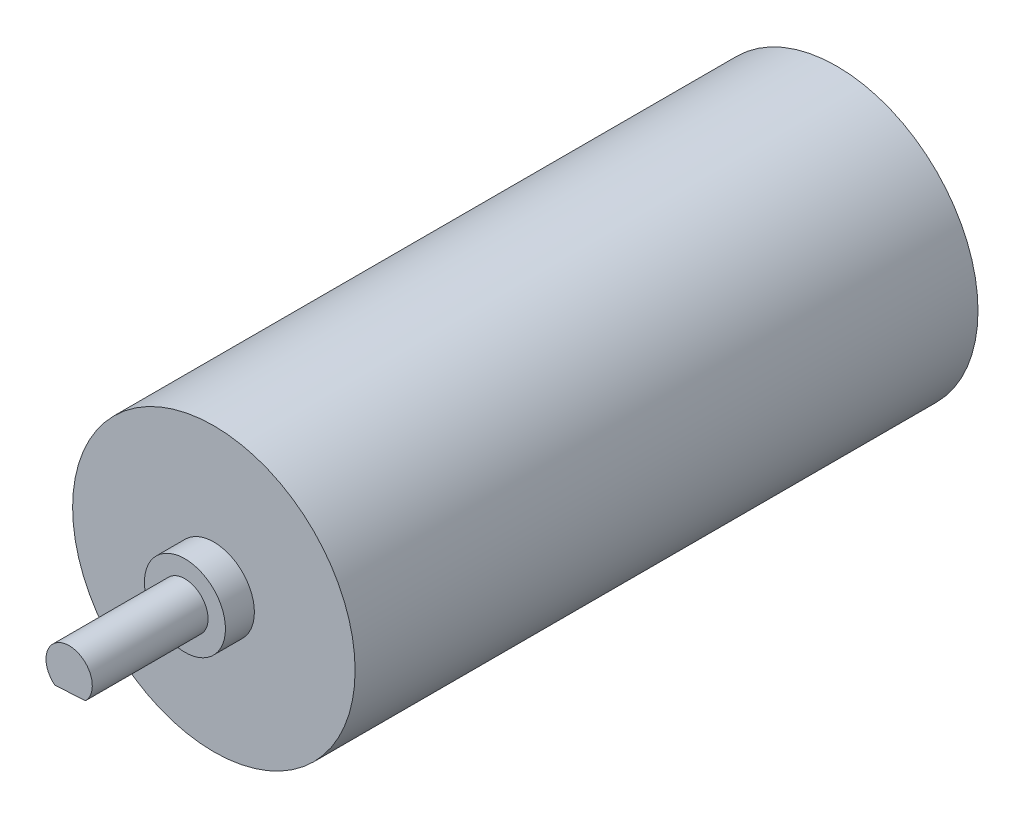
ISO-10303-21;
HEADER;
FILE_DESCRIPTION(('STEP AP214'),'2;1');
FILE_NAME('part.step','',(''),(''),'','','');
FILE_SCHEMA(('AUTOMOTIVE_DESIGN { 1 0 10303 214 1 1 1 1 }'));
ENDSEC;
DATA;
#1=APPLICATION_CONTEXT('core data for automotive mechanical design processes');
#2=APPLICATION_PROTOCOL_DEFINITION('international standard','automotive_design',2000,#1);
#3=PRODUCT_CONTEXT('',#1,'mechanical');
#4=PRODUCT('Part','Part','',(#3));
#5=PRODUCT_RELATED_PRODUCT_CATEGORY('part','',(#4));
#6=PRODUCT_DEFINITION_FORMATION('','',#4);
#7=PRODUCT_DEFINITION_CONTEXT('part definition',#1,'design');
#8=PRODUCT_DEFINITION('design','',#6,#7);
#9=PRODUCT_DEFINITION_SHAPE('','',#8);
#10=(LENGTH_UNIT() NAMED_UNIT(*) SI_UNIT(.MILLI.,.METRE.));
#11=(NAMED_UNIT(*) PLANE_ANGLE_UNIT() SI_UNIT($,.RADIAN.));
#12=(NAMED_UNIT(*) SI_UNIT($,.STERADIAN.) SOLID_ANGLE_UNIT());
#13=UNCERTAINTY_MEASURE_WITH_UNIT(LENGTH_MEASURE(1.E-05),#10,'distance_accuracy_value','');
#14=(GEOMETRIC_REPRESENTATION_CONTEXT(3) GLOBAL_UNCERTAINTY_ASSIGNED_CONTEXT((#13)) GLOBAL_UNIT_ASSIGNED_CONTEXT((#10,
#11,#12)) REPRESENTATION_CONTEXT('',''));
#15=CARTESIAN_POINT('',(0.,0.,0.));
#16=DIRECTION('',(0.,0.,1.));
#17=DIRECTION('',(1.,0.,0.));
#18=AXIS2_PLACEMENT_3D('',#15,#16,#17);
#19=CARTESIAN_POINT('',(0.,0.,26.9));
#20=DIRECTION('',(0.,0.,-1.));
#21=DIRECTION('',(-1.,0.,0.));
#22=AXIS2_PLACEMENT_3D('',#19,#20,#21);
#23=CYLINDRICAL_SURFACE('',#22,12.2);
#24=CARTESIAN_POINT('',(0.,0.,26.9));
#25=DIRECTION('',(0.,0.,1.));
#26=DIRECTION('',(1.,0.,0.));
#27=AXIS2_PLACEMENT_3D('',#24,#25,#26);
#28=CIRCLE('',#27,12.2);
#29=CARTESIAN_POINT('',(12.2,0.,26.9));
#30=VERTEX_POINT('',#29);
#31=EDGE_CURVE('E81',#30,#30,#28,.T.);
#32=ORIENTED_EDGE('',*,*,#31,.F.);
#33=EDGE_LOOP('',(#32));
#34=FACE_BOUND('',#33,.T.);
#35=CARTESIAN_POINT('',(0.,0.,-26.9));
#36=DIRECTION('',(0.,0.,1.));
#37=DIRECTION('',(1.,0.,0.));
#38=AXIS2_PLACEMENT_3D('',#35,#36,#37);
#39=CIRCLE('',#38,12.2);
#40=CARTESIAN_POINT('',(12.2,0.,-26.9));
#41=VERTEX_POINT('',#40);
#42=EDGE_CURVE('E36',#41,#41,#39,.T.);
#43=ORIENTED_EDGE('',*,*,#42,.T.);
#44=EDGE_LOOP('',(#43));
#45=FACE_BOUND('',#44,.T.);
#46=ADVANCED_FACE('F33',(#34,#45),#23,.T.);
#47=CARTESIAN_POINT('',(0.,0.,26.9));
#48=DIRECTION('',(0.,0.,1.));
#49=DIRECTION('',(1.,0.,0.));
#50=AXIS2_PLACEMENT_3D('',#47,#48,#49);
#51=PLANE('',#50);
#52=CARTESIAN_POINT('',(0.,0.,26.9));
#53=DIRECTION('',(0.,0.,1.));
#54=DIRECTION('',(1.,0.,0.));
#55=AXIS2_PLACEMENT_3D('',#52,#53,#54);
#56=CIRCLE('',#55,3.5);
#57=CARTESIAN_POINT('',(3.5,0.,26.9));
#58=VERTEX_POINT('',#57);
#59=EDGE_CURVE('E41',#58,#58,#56,.T.);
#60=ORIENTED_EDGE('',*,*,#59,.F.);
#61=EDGE_LOOP('',(#60));
#62=FACE_BOUND('',#61,.T.);
#63=ORIENTED_EDGE('',*,*,#31,.T.);
#64=EDGE_LOOP('',(#63));
#65=FACE_BOUND('',#64,.T.);
#66=ADVANCED_FACE('F92',(#62,#65),#51,.T.);
#67=CARTESIAN_POINT('',(0.,0.,-26.9));
#68=DIRECTION('',(0.,0.,1.));
#69=DIRECTION('',(1.,0.,0.));
#70=AXIS2_PLACEMENT_3D('',#67,#68,#69);
#71=PLANE('',#70);
#72=ORIENTED_EDGE('',*,*,#42,.F.);
#73=EDGE_LOOP('',(#72));
#74=FACE_BOUND('',#73,.T.);
#75=ADVANCED_FACE('F89',(#74),#71,.F.);
#76=CARTESIAN_POINT('',(0.,0.,29.4));
#77=DIRECTION('',(0.,0.,-1.));
#78=DIRECTION('',(-1.,0.,0.));
#79=AXIS2_PLACEMENT_3D('',#76,#77,#78);
#80=CYLINDRICAL_SURFACE('',#79,3.5);
#81=CARTESIAN_POINT('',(0.,0.,29.4));
#82=DIRECTION('',(0.,0.,1.));
#83=DIRECTION('',(1.,0.,0.));
#84=AXIS2_PLACEMENT_3D('',#81,#82,#83);
#85=CIRCLE('',#84,3.5);
#86=CARTESIAN_POINT('',(3.5,0.,29.4));
#87=VERTEX_POINT('',#86);
#88=EDGE_CURVE('E74',#87,#87,#85,.T.);
#89=ORIENTED_EDGE('',*,*,#88,.F.);
#90=EDGE_LOOP('',(#89));
#91=FACE_BOUND('',#90,.T.);
#92=ORIENTED_EDGE('',*,*,#59,.T.);
#93=EDGE_LOOP('',(#92));
#94=FACE_BOUND('',#93,.T.);
#95=ADVANCED_FACE('F91',(#91,#94),#80,.T.);
#96=CARTESIAN_POINT('',(0.,0.,29.4));
#97=DIRECTION('',(0.,0.,1.));
#98=DIRECTION('',(1.,0.,0.));
#99=AXIS2_PLACEMENT_3D('',#96,#97,#98);
#100=PLANE('',#99);
#101=CARTESIAN_POINT('',(0.,0.,29.4));
#102=DIRECTION('',(0.,0.,1.));
#103=DIRECTION('',(1.,0.,0.));
#104=AXIS2_PLACEMENT_3D('',#101,#102,#103);
#105=CIRCLE('',#104,2.);
#106=CARTESIAN_POINT('',(2.,0.,29.4));
#107=VERTEX_POINT('',#106);
#108=EDGE_CURVE('E11',#107,#107,#105,.T.);
#109=ORIENTED_EDGE('',*,*,#108,.F.);
#110=EDGE_LOOP('',(#109));
#111=FACE_BOUND('',#110,.T.);
#112=ORIENTED_EDGE('',*,*,#88,.T.);
#113=EDGE_LOOP('',(#112));
#114=FACE_BOUND('',#113,.T.);
#115=ADVANCED_FACE('F97',(#111,#114),#100,.T.);
#116=CARTESIAN_POINT('',(0.,0.,39.4));
#117=DIRECTION('',(0.,0.,-1.));
#118=DIRECTION('',(-1.,0.,0.));
#119=AXIS2_PLACEMENT_3D('',#116,#117,#118);
#120=CYLINDRICAL_SURFACE('',#119,2.);
#121=CARTESIAN_POINT('',(0.,0.,39.4));
#122=DIRECTION('',(0.,0.,1.));
#123=DIRECTION('',(1.,0.,0.));
#124=AXIS2_PLACEMENT_3D('',#121,#122,#123);
#125=CIRCLE('',#124,2.);
#126=CARTESIAN_POINT('',(1.40749511869052,-1.4209002395884,39.4));
#127=VERTEX_POINT('',#126);
#128=CARTESIAN_POINT('',(-1.23381886208231,-1.57406830079572,39.4));
#129=VERTEX_POINT('',#128);
#130=EDGE_CURVE('E71',#127,#129,#125,.T.);
#131=ORIENTED_EDGE('',*,*,#130,.F.);
#132=DIRECTION('',(0.,0.,1.));
#133=VECTOR('',#132,1.);
#134=CARTESIAN_POINT('',(1.40749511869051,-1.4209002395884,31.4));
#135=LINE('',#134,#133);
#136=CARTESIAN_POINT('',(1.40749511869051,-1.4209002395884,31.4));
#137=VERTEX_POINT('',#136);
#138=EDGE_CURVE('E49',#137,#127,#135,.T.);
#139=ORIENTED_EDGE('',*,*,#138,.F.);
#140=CARTESIAN_POINT('',(0.,0.,31.4));
#141=DIRECTION('',(0.,0.,1.));
#142=DIRECTION('',(1.,0.,0.));
#143=AXIS2_PLACEMENT_3D('',#140,#141,#142);
#144=CIRCLE('',#143,2.);
#145=CARTESIAN_POINT('',(-1.23381886208231,-1.57406830079572,31.4));
#146=VERTEX_POINT('',#145);
#147=EDGE_CURVE('E65',#146,#137,#144,.T.);
#148=ORIENTED_EDGE('',*,*,#147,.F.);
#149=DIRECTION('',(0.,0.,1.));
#150=VECTOR('',#149,1.);
#151=CARTESIAN_POINT('',(-1.23381886208231,-1.57406830079572,31.4));
#152=LINE('',#151,#150);
#153=EDGE_CURVE('E55',#146,#129,#152,.T.);
#154=ORIENTED_EDGE('',*,*,#153,.T.);
#155=EDGE_LOOP('',(#131,#139,#148,#154));
#156=FACE_BOUND('',#155,.T.);
#157=ORIENTED_EDGE('',*,*,#108,.T.);
#158=EDGE_LOOP('',(#157));
#159=FACE_BOUND('',#158,.T.);
#160=ADVANCED_FACE('F69',(#156,#159),#120,.T.);
#161=CARTESIAN_POINT('',(0.,0.,39.4));
#162=DIRECTION('',(0.,0.,1.));
#163=DIRECTION('',(1.,0.,0.));
#164=AXIS2_PLACEMENT_3D('',#161,#162,#163);
#165=PLANE('',#164);
#166=DIRECTION('',(-0.998322846794705,-0.0578920855360685,0.));
#167=VECTOR('',#166,1.);
#168=CARTESIAN_POINT('',(-1.23381886208231,-1.57406830079572,39.4));
#169=LINE('',#168,#167);
#170=EDGE_CURVE('E60',#127,#129,#169,.T.);
#171=ORIENTED_EDGE('',*,*,#170,.F.);
#172=ORIENTED_EDGE('',*,*,#130,.T.);
#173=EDGE_LOOP('',(#171,#172));
#174=FACE_BOUND('',#173,.T.);
#175=ADVANCED_FACE('F73',(#174),#165,.T.);
#176=CARTESIAN_POINT('',(-1.23381886208231,-1.57406830079572,31.4));
#177=DIRECTION('',(-0.0578920855360685,0.998322846794705,0.));
#178=DIRECTION('',(-0.998322846794705,-0.0578920855360685,0.));
#179=AXIS2_PLACEMENT_3D('',#176,#177,#178);
#180=PLANE('',#179);
#181=ORIENTED_EDGE('',*,*,#170,.T.);
#182=ORIENTED_EDGE('',*,*,#153,.F.);
#183=DIRECTION('',(-0.998322846794705,-0.0578920855360685,0.));
#184=VECTOR('',#183,1.);
#185=CARTESIAN_POINT('',(-1.23381886208231,-1.57406830079572,31.4));
#186=LINE('',#185,#184);
#187=EDGE_CURVE('E165',#137,#146,#186,.T.);
#188=ORIENTED_EDGE('',*,*,#187,.F.);
#189=ORIENTED_EDGE('',*,*,#138,.T.);
#190=EDGE_LOOP('',(#181,#182,#188,#189));
#191=FACE_BOUND('',#190,.T.);
#192=ADVANCED_FACE('F61',(#191),#180,.F.);
#193=CARTESIAN_POINT('',(0.,0.,31.4));
#194=DIRECTION('',(0.,0.,1.));
#195=DIRECTION('',(1.,0.,0.));
#196=AXIS2_PLACEMENT_3D('',#193,#194,#195);
#197=PLANE('',#196);
#198=ORIENTED_EDGE('',*,*,#147,.T.);
#199=ORIENTED_EDGE('',*,*,#187,.T.);
#200=EDGE_LOOP('',(#198,#199));
#201=FACE_BOUND('',#200,.T.);
#202=ADVANCED_FACE('F152',(#201),#197,.T.);
#203=CLOSED_SHELL('',(#46,#66,#75,#95,#115,#160,#175,#192,#202));
#204=MANIFOLD_SOLID_BREP('B2',#203);
#205=ADVANCED_BREP_SHAPE_REPRESENTATION('',(#18,#204),#14);
#206=SHAPE_DEFINITION_REPRESENTATION(#9,#205);
ENDSEC;
END-ISO-10303-21;
